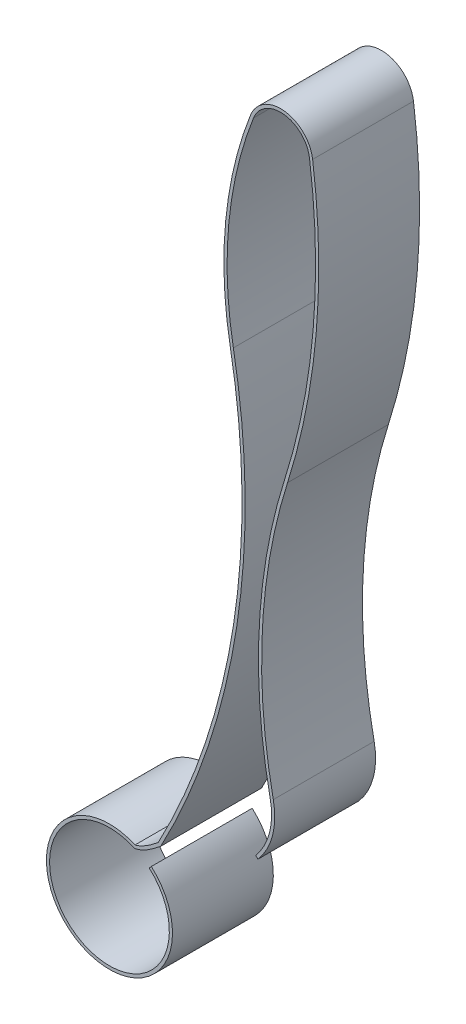
ISO-10303-21;
HEADER;
FILE_DESCRIPTION(('STEP AP214'),'2;1');
FILE_NAME('part.step','',(''),(''),'','','');
FILE_SCHEMA(('AUTOMOTIVE_DESIGN { 1 0 10303 214 1 1 1 1 }'));
ENDSEC;
DATA;
#1=APPLICATION_CONTEXT('core data for automotive mechanical design processes');
#2=APPLICATION_PROTOCOL_DEFINITION('international standard','automotive_design',2000,#1);
#3=PRODUCT_CONTEXT('',#1,'mechanical');
#4=PRODUCT('Part','Part','',(#3));
#5=PRODUCT_RELATED_PRODUCT_CATEGORY('part','',(#4));
#6=PRODUCT_DEFINITION_FORMATION('','',#4);
#7=PRODUCT_DEFINITION_CONTEXT('part definition',#1,'design');
#8=PRODUCT_DEFINITION('design','',#6,#7);
#9=PRODUCT_DEFINITION_SHAPE('','',#8);
#10=(LENGTH_UNIT() NAMED_UNIT(*) SI_UNIT(.MILLI.,.METRE.));
#11=(NAMED_UNIT(*) PLANE_ANGLE_UNIT() SI_UNIT($,.RADIAN.));
#12=(NAMED_UNIT(*) SI_UNIT($,.STERADIAN.) SOLID_ANGLE_UNIT());
#13=UNCERTAINTY_MEASURE_WITH_UNIT(LENGTH_MEASURE(1.E-05),#10,'distance_accuracy_value','');
#14=(GEOMETRIC_REPRESENTATION_CONTEXT(3) GLOBAL_UNCERTAINTY_ASSIGNED_CONTEXT((#13)) GLOBAL_UNIT_ASSIGNED_CONTEXT((#10,
#11,#12)) REPRESENTATION_CONTEXT('',''));
#15=CARTESIAN_POINT('',(0.,0.,0.));
#16=DIRECTION('',(0.,0.,1.));
#17=DIRECTION('',(1.,0.,0.));
#18=AXIS2_PLACEMENT_3D('',#15,#16,#17);
#19=CARTESIAN_POINT('',(-8.17273828626553,14.9561422023251,1.6));
#20=CARTESIAN_POINT('',(-8.39188921671194,14.7736546623473,1.6));
#21=CARTESIAN_POINT('',(-8.54075743139394,14.738914191593,1.6));
#22=B_SPLINE_CURVE_WITH_KNOTS('',2,(#19,#20,#21),.UNSPECIFIED.,.F.,.F.,(3,3),(0.,1.),.UNSPECIFIED.);
#23=DIRECTION('',(0.,0.,-1.));
#24=VECTOR('',#23,1.);
#25=SURFACE_OF_LINEAR_EXTRUSION('',#22,#24);
#26=CARTESIAN_POINT('',(-8.17273828626553,14.9561422023251,0.));
#27=CARTESIAN_POINT('',(-8.39188921671194,14.7736546623473,0.));
#28=CARTESIAN_POINT('',(-8.54075743139394,14.738914191593,0.));
#29=B_SPLINE_CURVE_WITH_KNOTS('',2,(#26,#27,#28),.UNSPECIFIED.,.F.,.F.,(3,3),(0.,1.),.UNSPECIFIED.);
#30=CARTESIAN_POINT('',(-8.17273828626552,14.9561422023251,0.));
#31=VERTEX_POINT('',#30);
#32=CARTESIAN_POINT('',(-8.54075743139394,14.738914191593,0.));
#33=VERTEX_POINT('',#32);
#34=EDGE_CURVE('E190',#31,#33,#29,.T.);
#35=ORIENTED_EDGE('',*,*,#34,.T.);
#36=DIRECTION('',(0.,0.,-1.));
#37=VECTOR('',#36,1.);
#38=CARTESIAN_POINT('',(-8.54075743139394,14.738914191593,1.6));
#39=LINE('',#38,#37);
#40=CARTESIAN_POINT('',(-8.54075743139394,14.738914191593,1.6));
#41=VERTEX_POINT('',#40);
#42=EDGE_CURVE('E11',#41,#33,#39,.T.);
#43=ORIENTED_EDGE('',*,*,#42,.F.);
#44=CARTESIAN_POINT('',(-8.17273828626552,14.9561422023251,1.6));
#45=VERTEX_POINT('',#44);
#46=EDGE_CURVE('E234',#45,#41,#22,.T.);
#47=ORIENTED_EDGE('',*,*,#46,.F.);
#48=DIRECTION('',(0.,0.,-1.));
#49=VECTOR('',#48,1.);
#50=CARTESIAN_POINT('',(-8.17273828626552,14.9561422023251,1.6));
#51=LINE('',#50,#49);
#52=EDGE_CURVE('E186',#45,#31,#51,.T.);
#53=ORIENTED_EDGE('',*,*,#52,.T.);
#54=EDGE_LOOP('',(#35,#43,#47,#53));
#55=FACE_BOUND('',#54,.T.);
#56=ADVANCED_FACE('F33',(#55),#25,.F.);
#57=CARTESIAN_POINT('',(-8.9465366735995,13.8249430724678,1.6));
#58=DIRECTION('',(0.,0.,-1.));
#59=DIRECTION('',(-1.,0.,0.));
#60=AXIS2_PLACEMENT_3D('',#57,#58,#59);
#61=CYLINDRICAL_SURFACE('',#60,1.);
#62=CARTESIAN_POINT('',(-8.9465366735995,13.8249430724678,0.));
#63=DIRECTION('',(0.,0.,1.));
#64=DIRECTION('',(1.,0.,0.));
#65=AXIS2_PLACEMENT_3D('',#62,#63,#64);
#66=CIRCLE('',#65,1.);
#67=CARTESIAN_POINT('',(-8.28203595786263,14.5722307003495,0.));
#68=VERTEX_POINT('',#67);
#69=EDGE_CURVE('E195',#33,#68,#66,.T.);
#70=ORIENTED_EDGE('',*,*,#69,.T.);
#71=DIRECTION('',(0.,0.,-1.));
#72=VECTOR('',#71,1.);
#73=CARTESIAN_POINT('',(-8.28203595786263,14.5722307003495,1.6));
#74=LINE('',#73,#72);
#75=CARTESIAN_POINT('',(-8.28203595786263,14.5722307003495,1.6));
#76=VERTEX_POINT('',#75);
#77=EDGE_CURVE('E42',#76,#68,#74,.T.);
#78=ORIENTED_EDGE('',*,*,#77,.F.);
#79=CARTESIAN_POINT('',(-8.9465366735995,13.8249430724678,1.6));
#80=DIRECTION('',(0.,0.,1.));
#81=DIRECTION('',(1.,0.,0.));
#82=AXIS2_PLACEMENT_3D('',#79,#80,#81);
#83=CIRCLE('',#82,1.);
#84=EDGE_CURVE('E123',#41,#76,#83,.T.);
#85=ORIENTED_EDGE('',*,*,#84,.F.);
#86=ORIENTED_EDGE('',*,*,#42,.T.);
#87=EDGE_LOOP('',(#70,#78,#85,#86));
#88=FACE_BOUND('',#87,.T.);
#89=ADVANCED_FACE('F319',(#88),#61,.T.);
#90=CARTESIAN_POINT('',(-8.28203595786263,14.5722307003495,1.6));
#91=DIRECTION('',(0.747287627881804,-0.664500715736851,0.));
#92=DIRECTION('',(0.664500715736851,0.747287627881804,0.));
#93=AXIS2_PLACEMENT_3D('',#90,#91,#92);
#94=PLANE('',#93);
#95=DIRECTION('',(-0.664500715736851,-0.747287627881804,0.));
#96=VECTOR('',#95,1.);
#97=CARTESIAN_POINT('',(-8.28203595786263,14.5722307003495,0.));
#98=LINE('',#97,#96);
#99=CARTESIAN_POINT('',(-8.31526099364921,14.5348663189557,0.));
#100=VERTEX_POINT('',#99);
#101=EDGE_CURVE('E200',#68,#100,#98,.T.);
#102=ORIENTED_EDGE('',*,*,#101,.T.);
#103=DIRECTION('',(0.,0.,-1.));
#104=VECTOR('',#103,1.);
#105=CARTESIAN_POINT('',(-8.31526099364921,14.5348663189557,1.6));
#106=LINE('',#105,#104);
#107=CARTESIAN_POINT('',(-8.31526099364921,14.5348663189557,1.6));
#108=VERTEX_POINT('',#107);
#109=EDGE_CURVE('E271',#108,#100,#106,.T.);
#110=ORIENTED_EDGE('',*,*,#109,.F.);
#111=DIRECTION('',(-0.664500715736851,-0.747287627881804,0.));
#112=VECTOR('',#111,1.);
#113=CARTESIAN_POINT('',(-8.28203595786263,14.5722307003495,1.6));
#114=LINE('',#113,#112);
#115=EDGE_CURVE('E279',#76,#108,#114,.T.);
#116=ORIENTED_EDGE('',*,*,#115,.F.);
#117=ORIENTED_EDGE('',*,*,#77,.T.);
#118=EDGE_LOOP('',(#102,#110,#116,#117));
#119=FACE_BOUND('',#118,.T.);
#120=ADVANCED_FACE('F277',(#119),#94,.F.);
#121=CARTESIAN_POINT('',(-8.94653667359941,13.8249430724677,1.6));
#122=DIRECTION('',(0.,0.,-1.));
#123=DIRECTION('',(-1.,0.,0.));
#124=AXIS2_PLACEMENT_3D('',#121,#122,#123);
#125=CYLINDRICAL_SURFACE('',#124,0.950000000000367);
#126=CARTESIAN_POINT('',(-8.94653667359941,13.8249430724677,0.));
#127=DIRECTION('',(0.,0.,-1.));
#128=DIRECTION('',(1.,0.,0.));
#129=AXIS2_PLACEMENT_3D('',#126,#127,#128);
#130=CIRCLE('',#129,0.950000000000367);
#131=CARTESIAN_POINT('',(-8.54595590580208,14.6863576349587,0.));
#132=VERTEX_POINT('',#131);
#133=EDGE_CURVE('E202',#100,#132,#130,.T.);
#134=ORIENTED_EDGE('',*,*,#133,.T.);
#135=DIRECTION('',(0.,0.,-1.));
#136=VECTOR('',#135,1.);
#137=CARTESIAN_POINT('',(-8.54595590580208,14.6863576349587,1.6));
#138=LINE('',#137,#136);
#139=CARTESIAN_POINT('',(-8.54595590580208,14.6863576349587,1.6));
#140=VERTEX_POINT('',#139);
#141=EDGE_CURVE('E268',#140,#132,#138,.T.);
#142=ORIENTED_EDGE('',*,*,#141,.F.);
#143=CARTESIAN_POINT('',(-8.94653667359941,13.8249430724677,1.6));
#144=DIRECTION('',(0.,0.,-1.));
#145=DIRECTION('',(1.,0.,0.));
#146=AXIS2_PLACEMENT_3D('',#143,#144,#145);
#147=CIRCLE('',#146,0.950000000000367);
#148=EDGE_CURVE('E297',#108,#140,#147,.T.);
#149=ORIENTED_EDGE('',*,*,#148,.F.);
#150=ORIENTED_EDGE('',*,*,#109,.T.);
#151=EDGE_LOOP('',(#134,#142,#149,#150));
#152=FACE_BOUND('',#151,.T.);
#153=ADVANCED_FACE('F288',(#152),#125,.F.);
#154=CARTESIAN_POINT('',(-8.54595590580207,14.6863576349588,1.6));
#155=CARTESIAN_POINT('',(-8.47953212681612,14.7018585486775,1.6));
#156=CARTESIAN_POINT('',(-8.37102445711791,14.7428089461494,1.6));
#157=CARTESIAN_POINT('',(-8.20365081098095,14.865336036183,1.6));
#158=CARTESIAN_POINT('',(-8.13320742492987,14.9239944238156,1.6));
#159=B_SPLINE_CURVE_WITH_KNOTS('',3,(#154,#155,#156,#157,#158),.UNSPECIFIED.,.F.,.F.,(4,1,4),
(-0.05562425742923,0.480784625778837,1.0171935089869),.UNSPECIFIED.);
#160=DIRECTION('',(0.,0.,-1.));
#161=VECTOR('',#160,1.);
#162=SURFACE_OF_LINEAR_EXTRUSION('',#159,#161);
#163=CARTESIAN_POINT('',(-8.54595590580207,14.6863576349588,0.));
#164=CARTESIAN_POINT('',(-8.47953212681612,14.7018585486775,0.));
#165=CARTESIAN_POINT('',(-8.37102445711791,14.7428089461494,0.));
#166=CARTESIAN_POINT('',(-8.20365081098095,14.865336036183,0.));
#167=CARTESIAN_POINT('',(-8.13320742492987,14.9239944238156,0.));
#168=B_SPLINE_CURVE_WITH_KNOTS('',3,(#163,#164,#165,#166,#167),.UNSPECIFIED.,.F.,.F.,(4,1,4),
(-0.05562425742923,0.480784625778837,1.0171935089869),.UNSPECIFIED.);
#169=CARTESIAN_POINT('',(-8.13320742492987,14.9239944238156,0.));
#170=VERTEX_POINT('',#169);
#171=EDGE_CURVE('E204',#132,#170,#168,.T.);
#172=ORIENTED_EDGE('',*,*,#171,.T.);
#173=DIRECTION('',(0.,0.,-1.));
#174=VECTOR('',#173,1.);
#175=CARTESIAN_POINT('',(-8.13320742492987,14.9239944238156,1.6));
#176=LINE('',#175,#174);
#177=CARTESIAN_POINT('',(-8.13320742492987,14.9239944238156,1.6));
#178=VERTEX_POINT('',#177);
#179=EDGE_CURVE('E265',#178,#170,#176,.T.);
#180=ORIENTED_EDGE('',*,*,#179,.F.);
#181=EDGE_CURVE('E294',#140,#178,#159,.T.);
#182=ORIENTED_EDGE('',*,*,#181,.F.);
#183=ORIENTED_EDGE('',*,*,#141,.T.);
#184=EDGE_LOOP('',(#172,#180,#182,#183));
#185=FACE_BOUND('',#184,.T.);
#186=ADVANCED_FACE('F292',(#185),#162,.F.);
#187=CARTESIAN_POINT('',(-18.2024333464897,20.2885284716478,1.6));
#188=DIRECTION('',(0.,0.,-1.));
#189=DIRECTION('',(-1.,0.,0.));
#190=AXIS2_PLACEMENT_3D('',#187,#188,#189);
#191=CYLINDRICAL_SURFACE('',#190,11.4090988342534);
#192=CARTESIAN_POINT('',(-18.2024333464897,20.2885284716478,0.));
#193=DIRECTION('',(0.,0.,1.));
#194=DIRECTION('',(1.,0.,0.));
#195=AXIS2_PLACEMENT_3D('',#192,#193,#194);
#196=CIRCLE('',#195,11.4090988342534);
#197=CARTESIAN_POINT('',(-6.98073320684655,22.3478929818053,0.));
#198=VERTEX_POINT('',#197);
#199=EDGE_CURVE('E208',#170,#198,#196,.T.);
#200=ORIENTED_EDGE('',*,*,#199,.T.);
#201=DIRECTION('',(0.,0.,-1.));
#202=VECTOR('',#201,1.);
#203=CARTESIAN_POINT('',(-6.98073320684655,22.3478929818053,1.6));
#204=LINE('',#203,#202);
#205=CARTESIAN_POINT('',(-6.98073320684655,22.3478929818053,1.6));
#206=VERTEX_POINT('',#205);
#207=EDGE_CURVE('E262',#206,#198,#204,.T.);
#208=ORIENTED_EDGE('',*,*,#207,.F.);
#209=CARTESIAN_POINT('',(-18.2024333464897,20.2885284716478,1.6));
#210=DIRECTION('',(0.,0.,1.));
#211=DIRECTION('',(1.,0.,0.));
#212=AXIS2_PLACEMENT_3D('',#209,#210,#211);
#213=CIRCLE('',#212,11.4090988342534);
#214=EDGE_CURVE('E296',#178,#206,#213,.T.);
#215=ORIENTED_EDGE('',*,*,#214,.F.);
#216=ORIENTED_EDGE('',*,*,#179,.T.);
#217=EDGE_LOOP('',(#200,#208,#215,#216));
#218=FACE_BOUND('',#217,.T.);
#219=ADVANCED_FACE('F314',(#218),#191,.T.);
#220=CARTESIAN_POINT('',(-0.995849687865862,23.4462164589115,1.6));
#221=DIRECTION('',(0.,0.,-1.));
#222=DIRECTION('',(-1.,0.,0.));
#223=AXIS2_PLACEMENT_3D('',#220,#221,#222);
#224=CYLINDRICAL_SURFACE('',#223,6.08482910163706);
#225=CARTESIAN_POINT('',(-0.995849687865862,23.4462164589115,0.));
#226=DIRECTION('',(0.,0.,-1.));
#227=DIRECTION('',(-1.,0.,0.));
#228=AXIS2_PLACEMENT_3D('',#225,#226,#227);
#229=CIRCLE('',#228,6.08482910163706);
#230=CARTESIAN_POINT('',(-6.66121560909931,25.6663007308831,0.));
#231=VERTEX_POINT('',#230);
#232=EDGE_CURVE('E213',#198,#231,#229,.T.);
#233=ORIENTED_EDGE('',*,*,#232,.T.);
#234=DIRECTION('',(0.,0.,-1.));
#235=VECTOR('',#234,1.);
#236=CARTESIAN_POINT('',(-6.66121560909931,25.6663007308831,1.6));
#237=LINE('',#236,#235);
#238=CARTESIAN_POINT('',(-6.66121560909931,25.6663007308831,1.6));
#239=VERTEX_POINT('',#238);
#240=EDGE_CURVE('E259',#239,#231,#237,.T.);
#241=ORIENTED_EDGE('',*,*,#240,.F.);
#242=CARTESIAN_POINT('',(-0.995849687865862,23.4462164589115,1.6));
#243=DIRECTION('',(0.,0.,-1.));
#244=DIRECTION('',(-1.,0.,0.));
#245=AXIS2_PLACEMENT_3D('',#242,#243,#244);
#246=CIRCLE('',#245,6.08482910163706);
#247=EDGE_CURVE('E299',#206,#239,#246,.T.);
#248=ORIENTED_EDGE('',*,*,#247,.F.);
#249=ORIENTED_EDGE('',*,*,#207,.T.);
#250=EDGE_LOOP('',(#233,#241,#248,#249));
#251=FACE_BOUND('',#250,.T.);
#252=ADVANCED_FACE('F376',(#251),#224,.F.);
#253=CARTESIAN_POINT('',(-6.23065415574989,25.4975768171963,1.6));
#254=DIRECTION('',(0.,0.,-1.));
#255=DIRECTION('',(-1.,0.,0.));
#256=AXIS2_PLACEMENT_3D('',#253,#254,#255);
#257=CYLINDRICAL_SURFACE('',#256,0.46244018441324);
#258=CARTESIAN_POINT('',(-6.23065415574989,25.4975768171963,0.));
#259=DIRECTION('',(0.,0.,-1.));
#260=DIRECTION('',(-1.,0.,0.));
#261=AXIS2_PLACEMENT_3D('',#258,#259,#260);
#262=CIRCLE('',#261,0.46244018441324);
#263=CARTESIAN_POINT('',(-5.7724043607799,25.5596900168411,0.));
#264=VERTEX_POINT('',#263);
#265=EDGE_CURVE('E215',#231,#264,#262,.T.);
#266=ORIENTED_EDGE('',*,*,#265,.T.);
#267=DIRECTION('',(0.,0.,-1.));
#268=VECTOR('',#267,1.);
#269=CARTESIAN_POINT('',(-5.7724043607799,25.5596900168411,1.6));
#270=LINE('',#269,#268);
#271=CARTESIAN_POINT('',(-5.7724043607799,25.5596900168411,1.6));
#272=VERTEX_POINT('',#271);
#273=EDGE_CURVE('E256',#272,#264,#270,.T.);
#274=ORIENTED_EDGE('',*,*,#273,.F.);
#275=CARTESIAN_POINT('',(-6.23065415574989,25.4975768171963,1.6));
#276=DIRECTION('',(0.,0.,-1.));
#277=DIRECTION('',(-1.,0.,0.));
#278=AXIS2_PLACEMENT_3D('',#275,#276,#277);
#279=CIRCLE('',#278,0.46244018441324);
#280=EDGE_CURVE('E372',#239,#272,#279,.T.);
#281=ORIENTED_EDGE('',*,*,#280,.F.);
#282=ORIENTED_EDGE('',*,*,#240,.T.);
#283=EDGE_LOOP('',(#266,#274,#281,#282));
#284=FACE_BOUND('',#283,.T.);
#285=ADVANCED_FACE('F371',(#284),#257,.F.);
#286=CARTESIAN_POINT('',(-16.2815665802845,24.1352317885904,1.6));
#287=DIRECTION('',(0.,0.,-1.));
#288=DIRECTION('',(-1.,0.,0.));
#289=AXIS2_PLACEMENT_3D('',#286,#287,#288);
#290=CYLINDRICAL_SURFACE('',#289,10.6052615149224);
#291=CARTESIAN_POINT('',(-16.2815665802845,24.1352317885904,0.));
#292=DIRECTION('',(0.,0.,-1.));
#293=DIRECTION('',(-1.,0.,0.));
#294=AXIS2_PLACEMENT_3D('',#291,#292,#293);
#295=CIRCLE('',#294,10.6052615149224);
#296=CARTESIAN_POINT('',(-6.16921005623186,20.9396383647731,0.));
#297=VERTEX_POINT('',#296);
#298=EDGE_CURVE('E217',#264,#297,#295,.T.);
#299=ORIENTED_EDGE('',*,*,#298,.T.);
#300=DIRECTION('',(0.,0.,-1.));
#301=VECTOR('',#300,1.);
#302=CARTESIAN_POINT('',(-6.16921005623186,20.9396383647731,1.6));
#303=LINE('',#302,#301);
#304=CARTESIAN_POINT('',(-6.16921005623186,20.9396383647731,1.6));
#305=VERTEX_POINT('',#304);
#306=EDGE_CURVE('E253',#305,#297,#303,.T.);
#307=ORIENTED_EDGE('',*,*,#306,.F.);
#308=CARTESIAN_POINT('',(-16.2815665802845,24.1352317885904,1.6));
#309=DIRECTION('',(0.,0.,-1.));
#310=DIRECTION('',(-1.,0.,0.));
#311=AXIS2_PLACEMENT_3D('',#308,#309,#310);
#312=CIRCLE('',#311,10.6052615149224);
#313=EDGE_CURVE('E368',#272,#305,#312,.T.);
#314=ORIENTED_EDGE('',*,*,#313,.F.);
#315=ORIENTED_EDGE('',*,*,#273,.T.);
#316=EDGE_LOOP('',(#299,#307,#314,#315));
#317=FACE_BOUND('',#316,.T.);
#318=ADVANCED_FACE('F365',(#317),#290,.F.);
#319=CARTESIAN_POINT('',(2.30946474795672,18.2603027042375,1.6));
#320=DIRECTION('',(0.,0.,-1.));
#321=DIRECTION('',(-1.,0.,0.));
#322=AXIS2_PLACEMENT_3D('',#319,#320,#321);
#323=CYLINDRICAL_SURFACE('',#322,8.89194950598575);
#324=CARTESIAN_POINT('',(2.30946474795672,18.2603027042375,0.));
#325=DIRECTION('',(0.,0.,1.));
#326=DIRECTION('',(1.,0.,0.));
#327=AXIS2_PLACEMENT_3D('',#324,#325,#326);
#328=CIRCLE('',#327,8.89194950598575);
#329=CARTESIAN_POINT('',(-6.39593122728534,16.4484398696831,0.));
#330=VERTEX_POINT('',#329);
#331=EDGE_CURVE('E219',#297,#330,#328,.T.);
#332=ORIENTED_EDGE('',*,*,#331,.T.);
#333=DIRECTION('',(0.,0.,-1.));
#334=VECTOR('',#333,1.);
#335=CARTESIAN_POINT('',(-6.39593122728534,16.4484398696831,1.6));
#336=LINE('',#335,#334);
#337=CARTESIAN_POINT('',(-6.39593122728534,16.4484398696831,1.6));
#338=VERTEX_POINT('',#337);
#339=EDGE_CURVE('E250',#338,#330,#336,.T.);
#340=ORIENTED_EDGE('',*,*,#339,.F.);
#341=CARTESIAN_POINT('',(2.30946474795672,18.2603027042375,1.6));
#342=DIRECTION('',(0.,0.,1.));
#343=DIRECTION('',(1.,0.,0.));
#344=AXIS2_PLACEMENT_3D('',#341,#342,#343);
#345=CIRCLE('',#344,8.89194950598575);
#346=EDGE_CURVE('E359',#305,#338,#345,.T.);
#347=ORIENTED_EDGE('',*,*,#346,.F.);
#348=ORIENTED_EDGE('',*,*,#306,.T.);
#349=EDGE_LOOP('',(#332,#340,#347,#348));
#350=FACE_BOUND('',#349,.T.);
#351=ADVANCED_FACE('F358',(#350),#323,.T.);
#352=CARTESIAN_POINT('',(-7.4209582743536,16.2350999577161,1.6));
#353=DIRECTION('',(0.,0.,-1.));
#354=DIRECTION('',(-1.,0.,0.));
#355=AXIS2_PLACEMENT_3D('',#352,#353,#354);
#356=CYLINDRICAL_SURFACE('',#355,1.04699301108439);
#357=CARTESIAN_POINT('',(-7.4209582743536,16.2350999577161,0.));
#358=DIRECTION('',(0.,0.,-1.));
#359=DIRECTION('',(-1.,0.,0.));
#360=AXIS2_PLACEMENT_3D('',#357,#358,#359);
#361=CIRCLE('',#360,1.04699301108439);
#362=CARTESIAN_POINT('',(-6.62785471163849,15.5515934807401,0.));
#363=VERTEX_POINT('',#362);
#364=EDGE_CURVE('E221',#330,#363,#361,.T.);
#365=ORIENTED_EDGE('',*,*,#364,.T.);
#366=DIRECTION('',(0.,0.,-1.));
#367=VECTOR('',#366,1.);
#368=CARTESIAN_POINT('',(-6.62785471163849,15.5515934807401,1.6));
#369=LINE('',#368,#367);
#370=CARTESIAN_POINT('',(-6.62785471163849,15.5515934807401,1.6));
#371=VERTEX_POINT('',#370);
#372=EDGE_CURVE('E247',#371,#363,#369,.T.);
#373=ORIENTED_EDGE('',*,*,#372,.F.);
#374=CARTESIAN_POINT('',(-7.4209582743536,16.2350999577161,1.6));
#375=DIRECTION('',(0.,0.,-1.));
#376=DIRECTION('',(-1.,0.,0.));
#377=AXIS2_PLACEMENT_3D('',#374,#375,#376);
#378=CIRCLE('',#377,1.04699301108439);
#379=EDGE_CURVE('E354',#338,#371,#378,.T.);
#380=ORIENTED_EDGE('',*,*,#379,.F.);
#381=ORIENTED_EDGE('',*,*,#339,.T.);
#382=EDGE_LOOP('',(#365,#373,#380,#381));
#383=FACE_BOUND('',#382,.T.);
#384=ADVANCED_FACE('F353',(#383),#356,.F.);
#385=CARTESIAN_POINT('',(-6.62785471163849,15.5515934807401,1.6));
#386=DIRECTION('',(0.652828117991066,0.75750607150058,0.));
#387=DIRECTION('',(-0.757506071500581,0.652828117991066,0.));
#388=AXIS2_PLACEMENT_3D('',#385,#386,#387);
#389=PLANE('',#388);
#390=DIRECTION('',(0.75750607150058,-0.652828117991066,0.));
#391=VECTOR('',#390,1.);
#392=CARTESIAN_POINT('',(-6.62785471163849,15.5515934807401,0.));
#393=LINE('',#392,#391);
#394=CARTESIAN_POINT('',(-6.58997940806376,15.5189520748408,0.));
#395=VERTEX_POINT('',#394);
#396=EDGE_CURVE('E223',#363,#395,#393,.T.);
#397=ORIENTED_EDGE('',*,*,#396,.T.);
#398=DIRECTION('',(0.,0.,-1.));
#399=VECTOR('',#398,1.);
#400=CARTESIAN_POINT('',(-6.58997940806376,15.5189520748408,1.6));
#401=LINE('',#400,#399);
#402=CARTESIAN_POINT('',(-6.58997940806376,15.5189520748408,1.6));
#403=VERTEX_POINT('',#402);
#404=EDGE_CURVE('E244',#403,#395,#401,.T.);
#405=ORIENTED_EDGE('',*,*,#404,.F.);
#406=DIRECTION('',(0.75750607150058,-0.652828117991066,0.));
#407=VECTOR('',#406,1.);
#408=CARTESIAN_POINT('',(-6.62785471163849,15.5515934807401,1.6));
#409=LINE('',#408,#407);
#410=EDGE_CURVE('E350',#371,#403,#409,.T.);
#411=ORIENTED_EDGE('',*,*,#410,.F.);
#412=ORIENTED_EDGE('',*,*,#372,.T.);
#413=EDGE_LOOP('',(#397,#405,#411,#412));
#414=FACE_BOUND('',#413,.T.);
#415=ADVANCED_FACE('F347',(#414),#389,.F.);
#416=CARTESIAN_POINT('',(-7.4209582743536,16.2350999577161,1.6));
#417=DIRECTION('',(0.,0.,-1.));
#418=DIRECTION('',(-1.,0.,0.));
#419=AXIS2_PLACEMENT_3D('',#416,#417,#418);
#420=CYLINDRICAL_SURFACE('',#419,1.096993011084);
#421=CARTESIAN_POINT('',(-7.4209582743536,16.2350999577161,0.));
#422=DIRECTION('',(0.,0.,1.));
#423=DIRECTION('',(-1.,0.,0.));
#424=AXIS2_PLACEMENT_3D('',#421,#422,#423);
#425=CIRCLE('',#424,1.096993011084);
#426=CARTESIAN_POINT('',(-6.34698022970425,16.4586280901252,0.));
#427=VERTEX_POINT('',#426);
#428=EDGE_CURVE('E225',#395,#427,#425,.T.);
#429=ORIENTED_EDGE('',*,*,#428,.T.);
#430=DIRECTION('',(0.,0.,-1.));
#431=VECTOR('',#430,1.);
#432=CARTESIAN_POINT('',(-6.34698022970425,16.4586280901252,1.6));
#433=LINE('',#432,#431);
#434=CARTESIAN_POINT('',(-6.34698022970425,16.4586280901252,1.6));
#435=VERTEX_POINT('',#434);
#436=EDGE_CURVE('E241',#435,#427,#433,.T.);
#437=ORIENTED_EDGE('',*,*,#436,.F.);
#438=CARTESIAN_POINT('',(-7.4209582743536,16.2350999577161,1.6));
#439=DIRECTION('',(0.,0.,1.));
#440=DIRECTION('',(-1.,0.,0.));
#441=AXIS2_PLACEMENT_3D('',#438,#439,#440);
#442=CIRCLE('',#441,1.096993011084);
#443=EDGE_CURVE('E341',#403,#435,#442,.T.);
#444=ORIENTED_EDGE('',*,*,#443,.F.);
#445=ORIENTED_EDGE('',*,*,#404,.T.);
#446=EDGE_LOOP('',(#429,#437,#444,#445));
#447=FACE_BOUND('',#446,.T.);
#448=ADVANCED_FACE('F340',(#447),#420,.T.);
#449=CARTESIAN_POINT('',(2.30946474795672,18.2603027042375,1.6));
#450=DIRECTION('',(0.,0.,-1.));
#451=DIRECTION('',(-1.,0.,0.));
#452=AXIS2_PLACEMENT_3D('',#449,#450,#451);
#453=CYLINDRICAL_SURFACE('',#452,8.84194950598615);
#454=CARTESIAN_POINT('',(2.30946474795672,18.2603027042375,0.));
#455=DIRECTION('',(0.,0.,-1.));
#456=DIRECTION('',(1.,0.,0.));
#457=AXIS2_PLACEMENT_3D('',#454,#455,#456);
#458=CIRCLE('',#457,8.84194950598615);
#459=CARTESIAN_POINT('',(-6.12153392627625,20.9245722892252,0.));
#460=VERTEX_POINT('',#459);
#461=EDGE_CURVE('E227',#427,#460,#458,.T.);
#462=ORIENTED_EDGE('',*,*,#461,.T.);
#463=DIRECTION('',(0.,0.,-1.));
#464=VECTOR('',#463,1.);
#465=CARTESIAN_POINT('',(-6.12153392627625,20.9245722892252,1.6));
#466=LINE('',#465,#464);
#467=CARTESIAN_POINT('',(-6.12153392627625,20.9245722892252,1.6));
#468=VERTEX_POINT('',#467);
#469=EDGE_CURVE('E238',#468,#460,#466,.T.);
#470=ORIENTED_EDGE('',*,*,#469,.F.);
#471=CARTESIAN_POINT('',(2.30946474795672,18.2603027042375,1.6));
#472=DIRECTION('',(0.,0.,-1.));
#473=DIRECTION('',(1.,0.,0.));
#474=AXIS2_PLACEMENT_3D('',#471,#472,#473);
#475=CIRCLE('',#474,8.84194950598615);
#476=EDGE_CURVE('E336',#435,#468,#475,.T.);
#477=ORIENTED_EDGE('',*,*,#476,.F.);
#478=ORIENTED_EDGE('',*,*,#436,.T.);
#479=EDGE_LOOP('',(#462,#470,#477,#478));
#480=FACE_BOUND('',#479,.T.);
#481=ADVANCED_FACE('F335',(#480),#453,.F.);
#482=CARTESIAN_POINT('',(-16.2815665802845,24.1352317885904,1.6));
#483=DIRECTION('',(0.,0.,-1.));
#484=DIRECTION('',(-1.,0.,0.));
#485=AXIS2_PLACEMENT_3D('',#482,#483,#484);
#486=CYLINDRICAL_SURFACE('',#485,10.655261514922);
#487=CARTESIAN_POINT('',(-16.2815665802845,24.1352317885904,0.));
#488=DIRECTION('',(0.,0.,1.));
#489=DIRECTION('',(-1.,0.,0.));
#490=AXIS2_PLACEMENT_3D('',#487,#488,#489);
#491=CIRCLE('',#490,10.655261514922);
#492=CARTESIAN_POINT('',(-5.72285743445171,25.5664058259055,0.));
#493=VERTEX_POINT('',#492);
#494=EDGE_CURVE('E229',#460,#493,#491,.T.);
#495=ORIENTED_EDGE('',*,*,#494,.T.);
#496=DIRECTION('',(0.,0.,-1.));
#497=VECTOR('',#496,1.);
#498=CARTESIAN_POINT('',(-5.72285743445171,25.5664058259055,1.6));
#499=LINE('',#498,#497);
#500=CARTESIAN_POINT('',(-5.72285743445171,25.5664058259055,1.6));
#501=VERTEX_POINT('',#500);
#502=EDGE_CURVE('E181',#501,#493,#499,.T.);
#503=ORIENTED_EDGE('',*,*,#502,.F.);
#504=CARTESIAN_POINT('',(-16.2815665802845,24.1352317885904,1.6));
#505=DIRECTION('',(0.,0.,1.));
#506=DIRECTION('',(-1.,0.,0.));
#507=AXIS2_PLACEMENT_3D('',#504,#505,#506);
#508=CIRCLE('',#507,10.655261514922);
#509=EDGE_CURVE('E172',#468,#501,#508,.T.);
#510=ORIENTED_EDGE('',*,*,#509,.F.);
#511=ORIENTED_EDGE('',*,*,#469,.T.);
#512=EDGE_LOOP('',(#495,#503,#510,#511));
#513=FACE_BOUND('',#512,.T.);
#514=ADVANCED_FACE('F331',(#513),#486,.T.);
#515=CARTESIAN_POINT('',(-6.23065415574989,25.4975768171963,1.6));
#516=DIRECTION('',(0.,0.,-1.));
#517=DIRECTION('',(-1.,0.,0.));
#518=AXIS2_PLACEMENT_3D('',#515,#516,#517);
#519=CYLINDRICAL_SURFACE('',#518,0.512440184412843);
#520=CARTESIAN_POINT('',(-6.23065415574989,25.4975768171963,0.));
#521=DIRECTION('',(0.,0.,1.));
#522=DIRECTION('',(-1.,0.,0.));
#523=AXIS2_PLACEMENT_3D('',#520,#521,#522);
#524=CIRCLE('',#523,0.512440184412843);
#525=CARTESIAN_POINT('',(-6.7077688140173,25.6845435133415,0.));
#526=VERTEX_POINT('',#525);
#527=EDGE_CURVE('E180',#493,#526,#524,.T.);
#528=ORIENTED_EDGE('',*,*,#527,.T.);
#529=DIRECTION('',(0.,0.,-1.));
#530=VECTOR('',#529,1.);
#531=CARTESIAN_POINT('',(-6.7077688140173,25.6845435133415,1.6));
#532=LINE('',#531,#530);
#533=CARTESIAN_POINT('',(-6.7077688140173,25.6845435133415,1.6));
#534=VERTEX_POINT('',#533);
#535=EDGE_CURVE('E177',#534,#526,#532,.T.);
#536=ORIENTED_EDGE('',*,*,#535,.F.);
#537=CARTESIAN_POINT('',(-6.23065415574989,25.4975768171963,1.6));
#538=DIRECTION('',(0.,0.,1.));
#539=DIRECTION('',(-1.,0.,0.));
#540=AXIS2_PLACEMENT_3D('',#537,#538,#539);
#541=CIRCLE('',#540,0.512440184412843);
#542=EDGE_CURVE('E166',#501,#534,#541,.T.);
#543=ORIENTED_EDGE('',*,*,#542,.F.);
#544=ORIENTED_EDGE('',*,*,#502,.T.);
#545=EDGE_LOOP('',(#528,#536,#543,#544));
#546=FACE_BOUND('',#545,.T.);
#547=ADVANCED_FACE('F178',(#546),#519,.T.);
#548=CARTESIAN_POINT('',(-0.995849687865862,23.4462164589115,1.6));
#549=DIRECTION('',(0.,0.,-1.));
#550=DIRECTION('',(-1.,0.,0.));
#551=AXIS2_PLACEMENT_3D('',#548,#549,#550);
#552=CYLINDRICAL_SURFACE('',#551,6.13482910163666);
#553=CARTESIAN_POINT('',(-0.995849687865862,23.4462164589115,0.));
#554=DIRECTION('',(0.,0.,1.));
#555=DIRECTION('',(-1.,0.,0.));
#556=AXIS2_PLACEMENT_3D('',#553,#554,#555);
#557=CIRCLE('',#556,6.13482910163666);
#558=CARTESIAN_POINT('',(-7.02991193823708,22.3388678846436,0.));
#559=VERTEX_POINT('',#558);
#560=EDGE_CURVE('E109',#526,#559,#557,.T.);
#561=ORIENTED_EDGE('',*,*,#560,.T.);
#562=DIRECTION('',(0.,0.,-1.));
#563=VECTOR('',#562,1.);
#564=CARTESIAN_POINT('',(-7.02991193823708,22.3388678846436,1.6));
#565=LINE('',#564,#563);
#566=CARTESIAN_POINT('',(-7.02991193823708,22.3388678846436,1.6));
#567=VERTEX_POINT('',#566);
#568=EDGE_CURVE('E182',#567,#559,#565,.T.);
#569=ORIENTED_EDGE('',*,*,#568,.F.);
#570=CARTESIAN_POINT('',(-0.995849687865862,23.4462164589115,1.6));
#571=DIRECTION('',(0.,0.,1.));
#572=DIRECTION('',(-1.,0.,0.));
#573=AXIS2_PLACEMENT_3D('',#570,#571,#572);
#574=CIRCLE('',#573,6.13482910163666);
#575=EDGE_CURVE('E170',#534,#567,#574,.T.);
#576=ORIENTED_EDGE('',*,*,#575,.F.);
#577=ORIENTED_EDGE('',*,*,#535,.T.);
#578=EDGE_LOOP('',(#561,#569,#576,#577));
#579=FACE_BOUND('',#578,.T.);
#580=ADVANCED_FACE('F184',(#579),#552,.T.);
#581=CARTESIAN_POINT('',(-18.2024333464897,20.2885284716478,1.6));
#582=DIRECTION('',(0.,0.,-1.));
#583=DIRECTION('',(-1.,0.,0.));
#584=AXIS2_PLACEMENT_3D('',#581,#582,#583);
#585=CYLINDRICAL_SURFACE('',#584,11.3590988342538);
#586=CARTESIAN_POINT('',(-18.2024333464897,20.2885284716478,0.));
#587=DIRECTION('',(0.,0.,-1.));
#588=DIRECTION('',(1.,0.,0.));
#589=AXIS2_PLACEMENT_3D('',#586,#587,#588);
#590=CIRCLE('',#589,11.3590988342538);
#591=EDGE_CURVE('E115',#559,#31,#590,.T.);
#592=ORIENTED_EDGE('',*,*,#591,.T.);
#593=ORIENTED_EDGE('',*,*,#52,.F.);
#594=CARTESIAN_POINT('',(-18.2024333464897,20.2885284716478,1.6));
#595=DIRECTION('',(0.,0.,-1.));
#596=DIRECTION('',(1.,0.,0.));
#597=AXIS2_PLACEMENT_3D('',#594,#595,#596);
#598=CIRCLE('',#597,11.3590988342538);
#599=EDGE_CURVE('E50',#567,#45,#598,.T.);
#600=ORIENTED_EDGE('',*,*,#599,.F.);
#601=ORIENTED_EDGE('',*,*,#568,.T.);
#602=EDGE_LOOP('',(#592,#593,#600,#601));
#603=FACE_BOUND('',#602,.T.);
#604=ADVANCED_FACE('F413',(#603),#585,.F.);
#605=CARTESIAN_POINT('',(-8.37431853777084,14.8105914296532,1.6));
#606=DIRECTION('',(0.,0.,-1.));
#607=DIRECTION('',(-1.,0.,0.));
#608=AXIS2_PLACEMENT_3D('',#605,#606,#607);
#609=PLANE('',#608);
#610=ORIENTED_EDGE('',*,*,#46,.T.);
#611=ORIENTED_EDGE('',*,*,#84,.T.);
#612=ORIENTED_EDGE('',*,*,#115,.T.);
#613=ORIENTED_EDGE('',*,*,#148,.T.);
#614=ORIENTED_EDGE('',*,*,#181,.T.);
#615=ORIENTED_EDGE('',*,*,#214,.T.);
#616=ORIENTED_EDGE('',*,*,#247,.T.);
#617=ORIENTED_EDGE('',*,*,#280,.T.);
#618=ORIENTED_EDGE('',*,*,#313,.T.);
#619=ORIENTED_EDGE('',*,*,#346,.T.);
#620=ORIENTED_EDGE('',*,*,#379,.T.);
#621=ORIENTED_EDGE('',*,*,#410,.T.);
#622=ORIENTED_EDGE('',*,*,#443,.T.);
#623=ORIENTED_EDGE('',*,*,#476,.T.);
#624=ORIENTED_EDGE('',*,*,#509,.T.);
#625=ORIENTED_EDGE('',*,*,#542,.T.);
#626=ORIENTED_EDGE('',*,*,#575,.T.);
#627=ORIENTED_EDGE('',*,*,#599,.T.);
#628=EDGE_LOOP('',(#610,#611,#612,#613,#614,#615,#616,#617,#618,#619,#620,#621,#622,#623,#624,
#625,#626,#627));
#629=FACE_BOUND('',#628,.T.);
#630=ADVANCED_FACE('F168',(#629),#609,.F.);
#631=CARTESIAN_POINT('',(-8.37431853777084,14.8105914296532,0.));
#632=DIRECTION('',(0.,0.,-1.));
#633=DIRECTION('',(-1.,0.,0.));
#634=AXIS2_PLACEMENT_3D('',#631,#632,#633);
#635=PLANE('',#634);
#636=ORIENTED_EDGE('',*,*,#34,.F.);
#637=ORIENTED_EDGE('',*,*,#591,.F.);
#638=ORIENTED_EDGE('',*,*,#560,.F.);
#639=ORIENTED_EDGE('',*,*,#527,.F.);
#640=ORIENTED_EDGE('',*,*,#494,.F.);
#641=ORIENTED_EDGE('',*,*,#461,.F.);
#642=ORIENTED_EDGE('',*,*,#428,.F.);
#643=ORIENTED_EDGE('',*,*,#396,.F.);
#644=ORIENTED_EDGE('',*,*,#364,.F.);
#645=ORIENTED_EDGE('',*,*,#331,.F.);
#646=ORIENTED_EDGE('',*,*,#298,.F.);
#647=ORIENTED_EDGE('',*,*,#265,.F.);
#648=ORIENTED_EDGE('',*,*,#232,.F.);
#649=ORIENTED_EDGE('',*,*,#199,.F.);
#650=ORIENTED_EDGE('',*,*,#171,.F.);
#651=ORIENTED_EDGE('',*,*,#133,.F.);
#652=ORIENTED_EDGE('',*,*,#101,.F.);
#653=ORIENTED_EDGE('',*,*,#69,.F.);
#654=EDGE_LOOP('',(#636,#637,#638,#639,#640,#641,#642,#643,#644,#645,#646,#647,#648,#649,#650,
#651,#652,#653));
#655=FACE_BOUND('',#654,.T.);
#656=ADVANCED_FACE('F283',(#655),#635,.T.);
#657=CLOSED_SHELL('',(#56,#89,#120,#153,#186,#219,#252,#285,#318,#351,#384,#415,#448,#481,#514,
#547,#580,#604,#630,#656));
#658=MANIFOLD_SOLID_BREP('B2',#657);
#659=ADVANCED_BREP_SHAPE_REPRESENTATION('',(#18,#658),#14);
#660=SHAPE_DEFINITION_REPRESENTATION(#9,#659);
ENDSEC;
END-ISO-10303-21;
